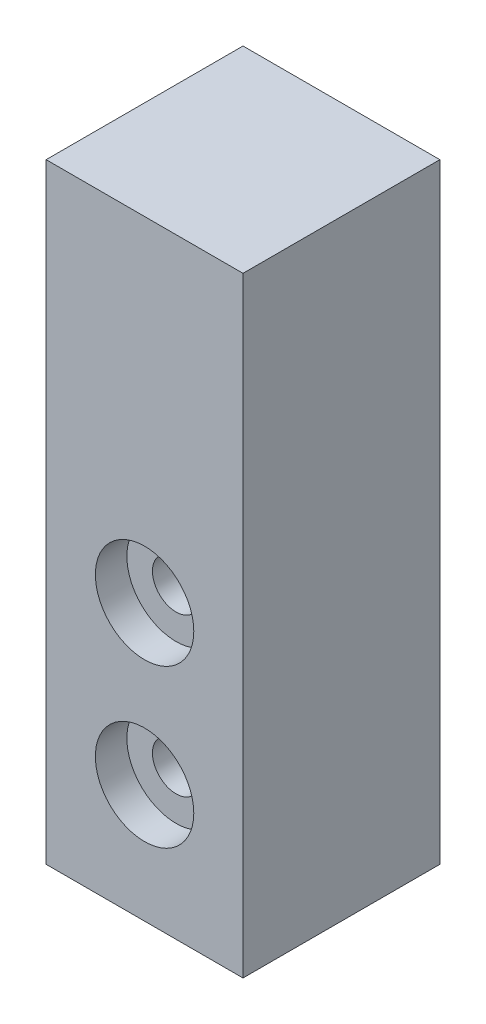
ISO-10303-21;
HEADER;
FILE_DESCRIPTION(('STEP AP214'),'2;1');
FILE_NAME('part.step','',(''),(''),'','','');
FILE_SCHEMA(('AUTOMOTIVE_DESIGN { 1 0 10303 214 1 1 1 1 }'));
ENDSEC;
DATA;
#1=APPLICATION_CONTEXT('core data for automotive mechanical design processes');
#2=APPLICATION_PROTOCOL_DEFINITION('international standard','automotive_design',2000,#1);
#3=PRODUCT_CONTEXT('',#1,'mechanical');
#4=PRODUCT('Part','Part','',(#3));
#5=PRODUCT_RELATED_PRODUCT_CATEGORY('part','',(#4));
#6=PRODUCT_DEFINITION_FORMATION('','',#4);
#7=PRODUCT_DEFINITION_CONTEXT('part definition',#1,'design');
#8=PRODUCT_DEFINITION('design','',#6,#7);
#9=PRODUCT_DEFINITION_SHAPE('','',#8);
#10=(LENGTH_UNIT() NAMED_UNIT(*) SI_UNIT(.MILLI.,.METRE.));
#11=(NAMED_UNIT(*) PLANE_ANGLE_UNIT() SI_UNIT($,.RADIAN.));
#12=(NAMED_UNIT(*) SI_UNIT($,.STERADIAN.) SOLID_ANGLE_UNIT());
#13=UNCERTAINTY_MEASURE_WITH_UNIT(LENGTH_MEASURE(1.E-05),#10,'distance_accuracy_value','');
#14=(GEOMETRIC_REPRESENTATION_CONTEXT(3) GLOBAL_UNCERTAINTY_ASSIGNED_CONTEXT((#13)) GLOBAL_UNIT_ASSIGNED_CONTEXT((#10,
#11,#12)) REPRESENTATION_CONTEXT('',''));
#15=CARTESIAN_POINT('',(0.,0.,0.));
#16=DIRECTION('',(0.,0.,1.));
#17=DIRECTION('',(1.,0.,0.));
#18=AXIS2_PLACEMENT_3D('',#15,#16,#17);
#19=CARTESIAN_POINT('',(0.,0.,10.));
#20=DIRECTION('',(1.,0.,0.));
#21=DIRECTION('',(0.,0.,-1.));
#22=AXIS2_PLACEMENT_3D('',#19,#20,#21);
#23=PLANE('',#22);
#24=DIRECTION('',(0.,-1.,0.));
#25=VECTOR('',#24,1.);
#26=CARTESIAN_POINT('',(0.,0.,0.));
#27=LINE('',#26,#25);
#28=CARTESIAN_POINT('',(0.,31.,0.));
#29=VERTEX_POINT('',#28);
#30=CARTESIAN_POINT('',(0.,0.,0.));
#31=VERTEX_POINT('',#30);
#32=EDGE_CURVE('E98',#29,#31,#27,.T.);
#33=ORIENTED_EDGE('',*,*,#32,.T.);
#34=DIRECTION('',(0.,0.,-1.));
#35=VECTOR('',#34,1.);
#36=CARTESIAN_POINT('',(0.,0.,10.));
#37=LINE('',#36,#35);
#38=CARTESIAN_POINT('',(0.,0.,10.));
#39=VERTEX_POINT('',#38);
#40=EDGE_CURVE('E11',#39,#31,#37,.T.);
#41=ORIENTED_EDGE('',*,*,#40,.F.);
#42=DIRECTION('',(0.,-1.,0.));
#43=VECTOR('',#42,1.);
#44=CARTESIAN_POINT('',(0.,0.,10.));
#45=LINE('',#44,#43);
#46=CARTESIAN_POINT('',(0.,31.,10.));
#47=VERTEX_POINT('',#46);
#48=EDGE_CURVE('E86',#47,#39,#45,.T.);
#49=ORIENTED_EDGE('',*,*,#48,.F.);
#50=DIRECTION('',(0.,0.,-1.));
#51=VECTOR('',#50,1.);
#52=CARTESIAN_POINT('',(0.,31.,10.));
#53=LINE('',#52,#51);
#54=EDGE_CURVE('E94',#47,#29,#53,.T.);
#55=ORIENTED_EDGE('',*,*,#54,.T.);
#56=EDGE_LOOP('',(#33,#41,#49,#55));
#57=FACE_BOUND('',#56,.T.);
#58=ADVANCED_FACE('F35',(#57),#23,.F.);
#59=CARTESIAN_POINT('',(0.,0.,10.));
#60=DIRECTION('',(0.,1.,0.));
#61=DIRECTION('',(0.,0.,1.));
#62=AXIS2_PLACEMENT_3D('',#59,#60,#61);
#63=PLANE('',#62);
#64=DIRECTION('',(1.,0.,0.));
#65=VECTOR('',#64,1.);
#66=CARTESIAN_POINT('',(0.,0.,0.));
#67=LINE('',#66,#65);
#68=CARTESIAN_POINT('',(10.,0.,0.));
#69=VERTEX_POINT('',#68);
#70=EDGE_CURVE('E90',#31,#69,#67,.T.);
#71=ORIENTED_EDGE('',*,*,#70,.T.);
#72=DIRECTION('',(0.,0.,-1.));
#73=VECTOR('',#72,1.);
#74=CARTESIAN_POINT('',(10.,0.,10.));
#75=LINE('',#74,#73);
#76=CARTESIAN_POINT('',(10.,0.,10.));
#77=VERTEX_POINT('',#76);
#78=EDGE_CURVE('E43',#77,#69,#75,.T.);
#79=ORIENTED_EDGE('',*,*,#78,.F.);
#80=DIRECTION('',(1.,0.,0.));
#81=VECTOR('',#80,1.);
#82=CARTESIAN_POINT('',(0.,0.,10.));
#83=LINE('',#82,#81);
#84=EDGE_CURVE('E81',#39,#77,#83,.T.);
#85=ORIENTED_EDGE('',*,*,#84,.F.);
#86=ORIENTED_EDGE('',*,*,#40,.T.);
#87=EDGE_LOOP('',(#71,#79,#85,#86));
#88=FACE_BOUND('',#87,.T.);
#89=ADVANCED_FACE('F89',(#88),#63,.F.);
#90=CARTESIAN_POINT('',(10.,0.,10.));
#91=DIRECTION('',(-1.,0.,0.));
#92=DIRECTION('',(0.,0.,1.));
#93=AXIS2_PLACEMENT_3D('',#90,#91,#92);
#94=PLANE('',#93);
#95=DIRECTION('',(0.,1.,0.));
#96=VECTOR('',#95,1.);
#97=CARTESIAN_POINT('',(10.,0.,0.));
#98=LINE('',#97,#96);
#99=CARTESIAN_POINT('',(10.,31.,0.));
#100=VERTEX_POINT('',#99);
#101=EDGE_CURVE('E68',#69,#100,#98,.T.);
#102=ORIENTED_EDGE('',*,*,#101,.T.);
#103=DIRECTION('',(0.,0.,-1.));
#104=VECTOR('',#103,1.);
#105=CARTESIAN_POINT('',(10.,31.,10.));
#106=LINE('',#105,#104);
#107=CARTESIAN_POINT('',(10.,31.,10.));
#108=VERTEX_POINT('',#107);
#109=EDGE_CURVE('E91',#108,#100,#106,.T.);
#110=ORIENTED_EDGE('',*,*,#109,.F.);
#111=DIRECTION('',(0.,1.,0.));
#112=VECTOR('',#111,1.);
#113=CARTESIAN_POINT('',(10.,0.,10.));
#114=LINE('',#113,#112);
#115=EDGE_CURVE('E84',#77,#108,#114,.T.);
#116=ORIENTED_EDGE('',*,*,#115,.F.);
#117=ORIENTED_EDGE('',*,*,#78,.T.);
#118=EDGE_LOOP('',(#102,#110,#116,#117));
#119=FACE_BOUND('',#118,.T.);
#120=ADVANCED_FACE('F92',(#119),#94,.F.);
#121=CARTESIAN_POINT('',(0.,31.,10.));
#122=DIRECTION('',(0.,-1.,0.));
#123=DIRECTION('',(0.,0.,-1.));
#124=AXIS2_PLACEMENT_3D('',#121,#122,#123);
#125=PLANE('',#124);
#126=DIRECTION('',(-1.,0.,0.));
#127=VECTOR('',#126,1.);
#128=CARTESIAN_POINT('',(0.,31.,0.));
#129=LINE('',#128,#127);
#130=EDGE_CURVE('E74',#100,#29,#129,.T.);
#131=ORIENTED_EDGE('',*,*,#130,.T.);
#132=ORIENTED_EDGE('',*,*,#54,.F.);
#133=DIRECTION('',(-1.,0.,0.));
#134=VECTOR('',#133,1.);
#135=CARTESIAN_POINT('',(0.,31.,10.));
#136=LINE('',#135,#134);
#137=EDGE_CURVE('E51',#108,#47,#136,.T.);
#138=ORIENTED_EDGE('',*,*,#137,.F.);
#139=ORIENTED_EDGE('',*,*,#109,.T.);
#140=EDGE_LOOP('',(#131,#132,#138,#139));
#141=FACE_BOUND('',#140,.T.);
#142=ADVANCED_FACE('F106',(#141),#125,.F.);
#143=CARTESIAN_POINT('',(0.,0.,10.));
#144=DIRECTION('',(0.,0.,-1.));
#145=DIRECTION('',(-1.,0.,0.));
#146=AXIS2_PLACEMENT_3D('',#143,#144,#145);
#147=PLANE('',#146);
#148=CARTESIAN_POINT('',(5.,14.,10.));
#149=DIRECTION('',(0.,0.,1.));
#150=DIRECTION('',(1.,0.,0.));
#151=AXIS2_PLACEMENT_3D('',#148,#149,#150);
#152=CIRCLE('',#151,2.5);
#153=CARTESIAN_POINT('',(7.5,14.,10.));
#154=VERTEX_POINT('',#153);
#155=EDGE_CURVE('E132',#154,#154,#152,.T.);
#156=ORIENTED_EDGE('',*,*,#155,.F.);
#157=EDGE_LOOP('',(#156));
#158=FACE_BOUND('',#157,.T.);
#159=CARTESIAN_POINT('',(5.,6.,10.));
#160=DIRECTION('',(0.,0.,1.));
#161=DIRECTION('',(1.,0.,0.));
#162=AXIS2_PLACEMENT_3D('',#159,#160,#161);
#163=CIRCLE('',#162,2.5);
#164=CARTESIAN_POINT('',(7.5,6.,10.));
#165=VERTEX_POINT('',#164);
#166=EDGE_CURVE('E120',#165,#165,#163,.T.);
#167=ORIENTED_EDGE('',*,*,#166,.F.);
#168=EDGE_LOOP('',(#167));
#169=FACE_BOUND('',#168,.T.);
#170=ORIENTED_EDGE('',*,*,#48,.T.);
#171=ORIENTED_EDGE('',*,*,#84,.T.);
#172=ORIENTED_EDGE('',*,*,#115,.T.);
#173=ORIENTED_EDGE('',*,*,#137,.T.);
#174=EDGE_LOOP('',(#170,#171,#172,#173));
#175=FACE_BOUND('',#174,.T.);
#176=ADVANCED_FACE('F82',(#158,#169,#175),#147,.F.);
#177=CARTESIAN_POINT('',(0.,0.,0.));
#178=DIRECTION('',(0.,0.,-1.));
#179=DIRECTION('',(-1.,0.,0.));
#180=AXIS2_PLACEMENT_3D('',#177,#178,#179);
#181=PLANE('',#180);
#182=CARTESIAN_POINT('',(5.,14.,0.));
#183=DIRECTION('',(0.,0.,1.));
#184=DIRECTION('',(1.,0.,0.));
#185=AXIS2_PLACEMENT_3D('',#182,#183,#184);
#186=CIRCLE('',#185,1.2);
#187=CARTESIAN_POINT('',(6.2,14.,0.));
#188=VERTEX_POINT('',#187);
#189=EDGE_CURVE('E123',#188,#188,#186,.T.);
#190=ORIENTED_EDGE('',*,*,#189,.T.);
#191=EDGE_LOOP('',(#190));
#192=FACE_BOUND('',#191,.T.);
#193=CARTESIAN_POINT('',(5.,6.,0.));
#194=DIRECTION('',(0.,0.,1.));
#195=DIRECTION('',(1.,0.,0.));
#196=AXIS2_PLACEMENT_3D('',#193,#194,#195);
#197=CIRCLE('',#196,1.2);
#198=CARTESIAN_POINT('',(6.2,6.,0.));
#199=VERTEX_POINT('',#198);
#200=EDGE_CURVE('E101',#199,#199,#197,.T.);
#201=ORIENTED_EDGE('',*,*,#200,.T.);
#202=EDGE_LOOP('',(#201));
#203=FACE_BOUND('',#202,.T.);
#204=ORIENTED_EDGE('',*,*,#32,.F.);
#205=ORIENTED_EDGE('',*,*,#130,.F.);
#206=ORIENTED_EDGE('',*,*,#101,.F.);
#207=ORIENTED_EDGE('',*,*,#70,.F.);
#208=EDGE_LOOP('',(#204,#205,#206,#207));
#209=FACE_BOUND('',#208,.T.);
#210=ADVANCED_FACE('F109',(#192,#203,#209),#181,.T.);
#211=CARTESIAN_POINT('',(5.,6.,10.));
#212=DIRECTION('',(0.,0.,1.));
#213=DIRECTION('',(1.,0.,0.));
#214=AXIS2_PLACEMENT_3D('',#211,#212,#213);
#215=CYLINDRICAL_SURFACE('',#214,1.2);
#216=ORIENTED_EDGE('',*,*,#200,.F.);
#217=EDGE_LOOP('',(#216));
#218=FACE_BOUND('',#217,.T.);
#219=CARTESIAN_POINT('',(5.,6.,8.4));
#220=DIRECTION('',(0.,0.,1.));
#221=DIRECTION('',(1.,0.,0.));
#222=AXIS2_PLACEMENT_3D('',#219,#220,#221);
#223=CIRCLE('',#222,1.2);
#224=CARTESIAN_POINT('',(6.2,6.,8.4));
#225=VERTEX_POINT('',#224);
#226=EDGE_CURVE('E114',#225,#225,#223,.T.);
#227=ORIENTED_EDGE('',*,*,#226,.T.);
#228=EDGE_LOOP('',(#227));
#229=FACE_BOUND('',#228,.T.);
#230=ADVANCED_FACE('F156',(#218,#229),#215,.F.);
#231=CARTESIAN_POINT('',(6.2,6.,8.4));
#232=DIRECTION('',(0.,0.,-1.));
#233=DIRECTION('',(-1.,0.,0.));
#234=AXIS2_PLACEMENT_3D('',#231,#232,#233);
#235=PLANE('',#234);
#236=ORIENTED_EDGE('',*,*,#226,.F.);
#237=EDGE_LOOP('',(#236));
#238=FACE_BOUND('',#237,.T.);
#239=CARTESIAN_POINT('',(5.,6.,8.4));
#240=DIRECTION('',(0.,0.,1.));
#241=DIRECTION('',(1.,0.,0.));
#242=AXIS2_PLACEMENT_3D('',#239,#240,#241);
#243=CIRCLE('',#242,2.5);
#244=CARTESIAN_POINT('',(7.5,6.,8.4));
#245=VERTEX_POINT('',#244);
#246=EDGE_CURVE('E117',#245,#245,#243,.T.);
#247=ORIENTED_EDGE('',*,*,#246,.T.);
#248=EDGE_LOOP('',(#247));
#249=FACE_BOUND('',#248,.T.);
#250=ADVANCED_FACE('F146',(#238,#249),#235,.F.);
#251=CARTESIAN_POINT('',(5.,6.,10.));
#252=DIRECTION('',(0.,0.,1.));
#253=DIRECTION('',(1.,0.,0.));
#254=AXIS2_PLACEMENT_3D('',#251,#252,#253);
#255=CYLINDRICAL_SURFACE('',#254,2.5);
#256=ORIENTED_EDGE('',*,*,#246,.F.);
#257=EDGE_LOOP('',(#256));
#258=FACE_BOUND('',#257,.T.);
#259=ORIENTED_EDGE('',*,*,#166,.T.);
#260=EDGE_LOOP('',(#259));
#261=FACE_BOUND('',#260,.T.);
#262=ADVANCED_FACE('F143',(#258,#261),#255,.F.);
#263=CARTESIAN_POINT('',(5.,14.,10.));
#264=DIRECTION('',(0.,0.,1.));
#265=DIRECTION('',(1.,0.,0.));
#266=AXIS2_PLACEMENT_3D('',#263,#264,#265);
#267=CYLINDRICAL_SURFACE('',#266,1.2);
#268=ORIENTED_EDGE('',*,*,#189,.F.);
#269=EDGE_LOOP('',(#268));
#270=FACE_BOUND('',#269,.T.);
#271=CARTESIAN_POINT('',(5.,14.,8.4));
#272=DIRECTION('',(0.,0.,1.));
#273=DIRECTION('',(1.,0.,0.));
#274=AXIS2_PLACEMENT_3D('',#271,#272,#273);
#275=CIRCLE('',#274,1.2);
#276=CARTESIAN_POINT('',(6.2,14.,8.4));
#277=VERTEX_POINT('',#276);
#278=EDGE_CURVE('E126',#277,#277,#275,.T.);
#279=ORIENTED_EDGE('',*,*,#278,.T.);
#280=EDGE_LOOP('',(#279));
#281=FACE_BOUND('',#280,.T.);
#282=ADVANCED_FACE('F145',(#270,#281),#267,.F.);
#283=CARTESIAN_POINT('',(6.2,14.,8.4));
#284=DIRECTION('',(0.,0.,-1.));
#285=DIRECTION('',(-1.,0.,0.));
#286=AXIS2_PLACEMENT_3D('',#283,#284,#285);
#287=PLANE('',#286);
#288=ORIENTED_EDGE('',*,*,#278,.F.);
#289=EDGE_LOOP('',(#288));
#290=FACE_BOUND('',#289,.T.);
#291=CARTESIAN_POINT('',(5.,14.,8.4));
#292=DIRECTION('',(0.,0.,1.));
#293=DIRECTION('',(1.,0.,0.));
#294=AXIS2_PLACEMENT_3D('',#291,#292,#293);
#295=CIRCLE('',#294,2.5);
#296=CARTESIAN_POINT('',(7.5,14.,8.4));
#297=VERTEX_POINT('',#296);
#298=EDGE_CURVE('E129',#297,#297,#295,.T.);
#299=ORIENTED_EDGE('',*,*,#298,.T.);
#300=EDGE_LOOP('',(#299));
#301=FACE_BOUND('',#300,.T.);
#302=ADVANCED_FACE('F153',(#290,#301),#287,.F.);
#303=CARTESIAN_POINT('',(5.,14.,10.));
#304=DIRECTION('',(0.,0.,1.));
#305=DIRECTION('',(1.,0.,0.));
#306=AXIS2_PLACEMENT_3D('',#303,#304,#305);
#307=CYLINDRICAL_SURFACE('',#306,2.5);
#308=ORIENTED_EDGE('',*,*,#298,.F.);
#309=EDGE_LOOP('',(#308));
#310=FACE_BOUND('',#309,.T.);
#311=ORIENTED_EDGE('',*,*,#155,.T.);
#312=EDGE_LOOP('',(#311));
#313=FACE_BOUND('',#312,.T.);
#314=ADVANCED_FACE('F136',(#310,#313),#307,.F.);
#315=CLOSED_SHELL('',(#58,#89,#120,#142,#176,#210,#230,#250,#262,#282,#302,#314));
#316=MANIFOLD_SOLID_BREP('B2',#315);
#317=ADVANCED_BREP_SHAPE_REPRESENTATION('',(#18,#316),#14);
#318=SHAPE_DEFINITION_REPRESENTATION(#9,#317);
ENDSEC;
END-ISO-10303-21;
